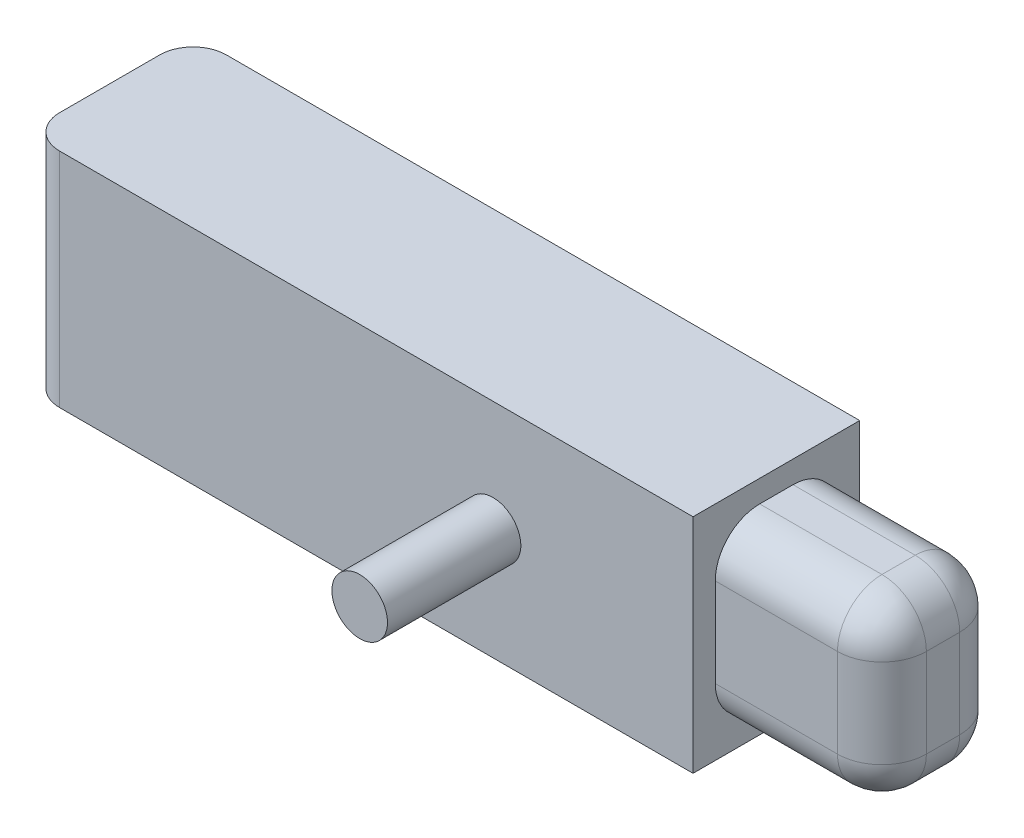
ISO-10303-21;
HEADER;
FILE_DESCRIPTION(('STEP AP214'),'2;1');
FILE_NAME('part.step','',(''),(''),'','','');
FILE_SCHEMA(('AUTOMOTIVE_DESIGN { 1 0 10303 214 1 1 1 1 }'));
ENDSEC;
DATA;
#1=APPLICATION_CONTEXT('core data for automotive mechanical design processes');
#2=APPLICATION_PROTOCOL_DEFINITION('international standard','automotive_design',2000,#1);
#3=PRODUCT_CONTEXT('',#1,'mechanical');
#4=PRODUCT('Part','Part','',(#3));
#5=PRODUCT_RELATED_PRODUCT_CATEGORY('part','',(#4));
#6=PRODUCT_DEFINITION_FORMATION('','',#4);
#7=PRODUCT_DEFINITION_CONTEXT('part definition',#1,'design');
#8=PRODUCT_DEFINITION('design','',#6,#7);
#9=PRODUCT_DEFINITION_SHAPE('','',#8);
#10=(LENGTH_UNIT() NAMED_UNIT(*) SI_UNIT(.MILLI.,.METRE.));
#11=(NAMED_UNIT(*) PLANE_ANGLE_UNIT() SI_UNIT($,.RADIAN.));
#12=(NAMED_UNIT(*) SI_UNIT($,.STERADIAN.) SOLID_ANGLE_UNIT());
#13=UNCERTAINTY_MEASURE_WITH_UNIT(LENGTH_MEASURE(1.E-05),#10,'distance_accuracy_value','');
#14=(GEOMETRIC_REPRESENTATION_CONTEXT(3) GLOBAL_UNCERTAINTY_ASSIGNED_CONTEXT((#13)) GLOBAL_UNIT_ASSIGNED_CONTEXT((#10,
#11,#12)) REPRESENTATION_CONTEXT('',''));
#15=CARTESIAN_POINT('',(0.,0.,0.));
#16=DIRECTION('',(0.,0.,1.));
#17=DIRECTION('',(1.,0.,0.));
#18=AXIS2_PLACEMENT_3D('',#15,#16,#17);
#19=CARTESIAN_POINT('',(55.594721876326,30.,14.8444549595951));
#20=DIRECTION('',(-1.,0.,0.));
#21=DIRECTION('',(0.,0.,1.));
#22=AXIS2_PLACEMENT_3D('',#19,#20,#21);
#23=PLANE('',#22);
#24=DIRECTION('',(0.,0.,-1.));
#25=VECTOR('',#24,1.);
#26=CARTESIAN_POINT('',(55.594721876326,-10.,14.8444549595951));
#27=LINE('',#26,#25);
#28=CARTESIAN_POINT('',(55.594721876326,-10.,14.8444549595951));
#29=VERTEX_POINT('',#28);
#30=CARTESIAN_POINT('',(55.594721876326,-10.,-15.1555450404049));
#31=VERTEX_POINT('',#30);
#32=EDGE_CURVE('E187',#29,#31,#27,.T.);
#33=ORIENTED_EDGE('',*,*,#32,.T.);
#34=DIRECTION('',(0.,-1.,0.));
#35=VECTOR('',#34,1.);
#36=CARTESIAN_POINT('',(55.594721876326,30.,-15.1555450404049));
#37=LINE('',#36,#35);
#38=CARTESIAN_POINT('',(55.594721876326,30.,-15.1555450404049));
#39=VERTEX_POINT('',#38);
#40=EDGE_CURVE('E173',#39,#31,#37,.T.);
#41=ORIENTED_EDGE('',*,*,#40,.F.);
#42=DIRECTION('',(0.,0.,-1.));
#43=VECTOR('',#42,1.);
#44=CARTESIAN_POINT('',(55.594721876326,30.,14.8444549595951));
#45=LINE('',#44,#43);
#46=CARTESIAN_POINT('',(55.594721876326,30.,14.8444549595951));
#47=VERTEX_POINT('',#46);
#48=EDGE_CURVE('E159',#47,#39,#45,.T.);
#49=ORIENTED_EDGE('',*,*,#48,.F.);
#50=DIRECTION('',(0.,-1.,0.));
#51=VECTOR('',#50,1.);
#52=CARTESIAN_POINT('',(55.594721876326,30.,14.8444549595951));
#53=LINE('',#52,#51);
#54=EDGE_CURVE('E166',#47,#29,#53,.T.);
#55=ORIENTED_EDGE('',*,*,#54,.T.);
#56=EDGE_LOOP('',(#33,#41,#49,#55));
#57=FACE_BOUND('',#56,.T.);
#58=DIRECTION('',(0.,-1.,0.));
#59=VECTOR('',#58,1.);
#60=CARTESIAN_POINT('',(55.594721876326,-6.,10.8444549595951));
#61=LINE('',#60,#59);
#62=CARTESIAN_POINT('',(55.594721876326,18.,10.8444549595951));
#63=VERTEX_POINT('',#62);
#64=CARTESIAN_POINT('',(55.594721876326,2.,10.8444549595951));
#65=VERTEX_POINT('',#64);
#66=EDGE_CURVE('E271',#63,#65,#61,.T.);
#67=ORIENTED_EDGE('',*,*,#66,.F.);
#68=CARTESIAN_POINT('',(55.594721876326,18.,2.84445495959507));
#69=DIRECTION('',(-1.,0.,0.));
#70=DIRECTION('',(0.,0.,1.));
#71=AXIS2_PLACEMENT_3D('',#68,#69,#70);
#72=CIRCLE('',#71,8.);
#73=CARTESIAN_POINT('',(55.594721876326,26.,2.84445495959507));
#74=VERTEX_POINT('',#73);
#75=EDGE_CURVE('E220',#63,#74,#72,.T.);
#76=ORIENTED_EDGE('',*,*,#75,.T.);
#77=DIRECTION('',(0.,0.,1.));
#78=VECTOR('',#77,1.);
#79=CARTESIAN_POINT('',(55.594721876326,26.,-11.1555450404049));
#80=LINE('',#79,#78);
#81=CARTESIAN_POINT('',(55.594721876326,26.,-3.15554504040493));
#82=VERTEX_POINT('',#81);
#83=EDGE_CURVE('E556',#82,#74,#80,.T.);
#84=ORIENTED_EDGE('',*,*,#83,.F.);
#85=CARTESIAN_POINT('',(55.594721876326,18.,-3.15554504040493));
#86=DIRECTION('',(-1.,0.,0.));
#87=DIRECTION('',(0.,0.,1.));
#88=AXIS2_PLACEMENT_3D('',#85,#86,#87);
#89=CIRCLE('',#88,8.);
#90=CARTESIAN_POINT('',(55.594721876326,18.,-11.1555450404049));
#91=VERTEX_POINT('',#90);
#92=EDGE_CURVE('E214',#82,#91,#89,.T.);
#93=ORIENTED_EDGE('',*,*,#92,.T.);
#94=DIRECTION('',(0.,1.,0.));
#95=VECTOR('',#94,1.);
#96=CARTESIAN_POINT('',(55.594721876326,-6.,-11.1555450404049));
#97=LINE('',#96,#95);
#98=CARTESIAN_POINT('',(55.594721876326,2.,-11.1555450404049));
#99=VERTEX_POINT('',#98);
#100=EDGE_CURVE('E559',#99,#91,#97,.T.);
#101=ORIENTED_EDGE('',*,*,#100,.F.);
#102=CARTESIAN_POINT('',(55.594721876326,2.,-3.15554504040493));
#103=DIRECTION('',(-1.,0.,0.));
#104=DIRECTION('',(0.,0.,1.));
#105=AXIS2_PLACEMENT_3D('',#102,#103,#104);
#106=CIRCLE('',#105,8.);
#107=CARTESIAN_POINT('',(55.594721876326,-6.,-3.15554504040493));
#108=VERTEX_POINT('',#107);
#109=EDGE_CURVE('E216',#99,#108,#106,.T.);
#110=ORIENTED_EDGE('',*,*,#109,.T.);
#111=DIRECTION('',(0.,0.,-1.));
#112=VECTOR('',#111,1.);
#113=CARTESIAN_POINT('',(55.594721876326,-6.,-11.1555450404049));
#114=LINE('',#113,#112);
#115=CARTESIAN_POINT('',(55.594721876326,-6.,2.84445495959507));
#116=VERTEX_POINT('',#115);
#117=EDGE_CURVE('E564',#116,#108,#114,.T.);
#118=ORIENTED_EDGE('',*,*,#117,.F.);
#119=CARTESIAN_POINT('',(55.594721876326,2.,2.84445495959507));
#120=DIRECTION('',(-1.,0.,0.));
#121=DIRECTION('',(0.,0.,1.));
#122=AXIS2_PLACEMENT_3D('',#119,#120,#121);
#123=CIRCLE('',#122,8.);
#124=EDGE_CURVE('E218',#116,#65,#123,.T.);
#125=ORIENTED_EDGE('',*,*,#124,.T.);
#126=EDGE_LOOP('',(#67,#76,#84,#93,#101,#110,#118,#125));
#127=FACE_BOUND('',#126,.T.);
#128=ADVANCED_FACE('F42',(#57,#127),#23,.F.);
#129=CARTESIAN_POINT('',(-64.405278123674,30.,14.8444549595951));
#130=DIRECTION('',(1.,0.,0.));
#131=DIRECTION('',(0.,0.,-1.));
#132=AXIS2_PLACEMENT_3D('',#129,#130,#131);
#133=PLANE('',#132);
#134=DIRECTION('',(0.,0.,1.));
#135=VECTOR('',#134,1.);
#136=CARTESIAN_POINT('',(-64.405278123674,30.,14.8444549595951));
#137=LINE('',#136,#135);
#138=CARTESIAN_POINT('',(-64.405278123674,30.,-9.15554504040492));
#139=VERTEX_POINT('',#138);
#140=CARTESIAN_POINT('',(-64.405278123674,30.,8.84445495959508));
#141=VERTEX_POINT('',#140);
#142=EDGE_CURVE('E163',#139,#141,#137,.T.);
#143=ORIENTED_EDGE('',*,*,#142,.F.);
#144=DIRECTION('',(0.,-1.,0.));
#145=VECTOR('',#144,1.);
#146=CARTESIAN_POINT('',(-64.405278123674,30.,-9.15554504040492));
#147=LINE('',#146,#145);
#148=CARTESIAN_POINT('',(-64.405278123674,-10.,-9.15554504040492));
#149=VERTEX_POINT('',#148);
#150=EDGE_CURVE('E273',#139,#149,#147,.T.);
#151=ORIENTED_EDGE('',*,*,#150,.T.);
#152=DIRECTION('',(0.,0.,1.));
#153=VECTOR('',#152,1.);
#154=CARTESIAN_POINT('',(-64.405278123674,-10.,14.8444549595951));
#155=LINE('',#154,#153);
#156=CARTESIAN_POINT('',(-64.405278123674,-10.,8.84445495959508));
#157=VERTEX_POINT('',#156);
#158=EDGE_CURVE('E182',#149,#157,#155,.T.);
#159=ORIENTED_EDGE('',*,*,#158,.T.);
#160=DIRECTION('',(0.,-1.,0.));
#161=VECTOR('',#160,1.);
#162=CARTESIAN_POINT('',(-64.405278123674,30.,8.84445495959508));
#163=LINE('',#162,#161);
#164=EDGE_CURVE('E248',#157,#141,#163,.F.);
#165=ORIENTED_EDGE('',*,*,#164,.T.);
#166=EDGE_LOOP('',(#143,#151,#159,#165));
#167=FACE_BOUND('',#166,.T.);
#168=ADVANCED_FACE('F286',(#167),#133,.F.);
#169=CARTESIAN_POINT('',(55.594721876326,30.,14.8444549595951));
#170=DIRECTION('',(0.,0.,-1.));
#171=DIRECTION('',(-1.,0.,0.));
#172=AXIS2_PLACEMENT_3D('',#169,#170,#171);
#173=PLANE('',#172);
#174=CARTESIAN_POINT('',(19.594721876326,10.,14.8444549595951));
#175=DIRECTION('',(0.,0.,-1.));
#176=DIRECTION('',(-1.,0.,0.));
#177=AXIS2_PLACEMENT_3D('',#174,#175,#176);
#178=CIRCLE('',#177,5.);
#179=CARTESIAN_POINT('',(14.594721876326,10.,14.8444549595951));
#180=VERTEX_POINT('',#179);
#181=EDGE_CURVE('E172',#180,#180,#178,.F.);
#182=ORIENTED_EDGE('',*,*,#181,.F.);
#183=EDGE_LOOP('',(#182));
#184=FACE_BOUND('',#183,.T.);
#185=DIRECTION('',(1.,0.,0.));
#186=VECTOR('',#185,1.);
#187=CARTESIAN_POINT('',(55.594721876326,30.,14.8444549595951));
#188=LINE('',#187,#186);
#189=CARTESIAN_POINT('',(-58.405278123674,30.,14.8444549595951));
#190=VERTEX_POINT('',#189);
#191=EDGE_CURVE('E155',#190,#47,#188,.T.);
#192=ORIENTED_EDGE('',*,*,#191,.F.);
#193=DIRECTION('',(0.,-1.,0.));
#194=VECTOR('',#193,1.);
#195=CARTESIAN_POINT('',(-58.405278123674,30.,14.8444549595951));
#196=LINE('',#195,#194);
#197=CARTESIAN_POINT('',(-58.405278123674,-10.,14.8444549595951));
#198=VERTEX_POINT('',#197);
#199=EDGE_CURVE('E11',#190,#198,#196,.T.);
#200=ORIENTED_EDGE('',*,*,#199,.T.);
#201=DIRECTION('',(1.,0.,0.));
#202=VECTOR('',#201,1.);
#203=CARTESIAN_POINT('',(55.594721876326,-10.,14.8444549595951));
#204=LINE('',#203,#202);
#205=EDGE_CURVE('E169',#198,#29,#204,.T.);
#206=ORIENTED_EDGE('',*,*,#205,.T.);
#207=ORIENTED_EDGE('',*,*,#54,.F.);
#208=EDGE_LOOP('',(#192,#200,#206,#207));
#209=FACE_BOUND('',#208,.T.);
#210=ADVANCED_FACE('F167',(#184,#209),#173,.F.);
#211=CARTESIAN_POINT('',(55.594721876326,30.,-15.1555450404049));
#212=DIRECTION('',(0.,0.,1.));
#213=DIRECTION('',(1.,0.,0.));
#214=AXIS2_PLACEMENT_3D('',#211,#212,#213);
#215=PLANE('',#214);
#216=DIRECTION('',(-1.,0.,0.));
#217=VECTOR('',#216,1.);
#218=CARTESIAN_POINT('',(55.594721876326,-10.,-15.1555450404049));
#219=LINE('',#218,#217);
#220=CARTESIAN_POINT('',(-58.405278123674,-10.,-15.1555450404049));
#221=VERTEX_POINT('',#220);
#222=EDGE_CURVE('E189',#31,#221,#219,.T.);
#223=ORIENTED_EDGE('',*,*,#222,.T.);
#224=DIRECTION('',(0.,-1.,0.));
#225=VECTOR('',#224,1.);
#226=CARTESIAN_POINT('',(-58.405278123674,30.,-15.1555450404049));
#227=LINE('',#226,#225);
#228=CARTESIAN_POINT('',(-58.405278123674,30.,-15.1555450404049));
#229=VERTEX_POINT('',#228);
#230=EDGE_CURVE('E65',#221,#229,#227,.F.);
#231=ORIENTED_EDGE('',*,*,#230,.T.);
#232=DIRECTION('',(-1.,0.,0.));
#233=VECTOR('',#232,1.);
#234=CARTESIAN_POINT('',(55.594721876326,30.,-15.1555450404049));
#235=LINE('',#234,#233);
#236=EDGE_CURVE('E177',#39,#229,#235,.T.);
#237=ORIENTED_EDGE('',*,*,#236,.F.);
#238=ORIENTED_EDGE('',*,*,#40,.T.);
#239=EDGE_LOOP('',(#223,#231,#237,#238));
#240=FACE_BOUND('',#239,.T.);
#241=ADVANCED_FACE('F293',(#240),#215,.F.);
#242=CARTESIAN_POINT('',(-4.40527812367396,30.,-0.155545040404923));
#243=DIRECTION('',(0.,1.,0.));
#244=DIRECTION('',(0.,0.,1.));
#245=AXIS2_PLACEMENT_3D('',#242,#243,#244);
#246=PLANE('',#245);
#247=ORIENTED_EDGE('',*,*,#236,.T.);
#248=CARTESIAN_POINT('',(-58.405278123674,30.,-9.15554504040492));
#249=DIRECTION('',(0.,1.,0.));
#250=DIRECTION('',(0.,0.,1.));
#251=AXIS2_PLACEMENT_3D('',#248,#249,#250);
#252=CIRCLE('',#251,6.);
#253=EDGE_CURVE('E50',#229,#139,#252,.T.);
#254=ORIENTED_EDGE('',*,*,#253,.T.);
#255=ORIENTED_EDGE('',*,*,#142,.T.);
#256=CARTESIAN_POINT('',(-58.405278123674,30.,8.84445495959508));
#257=DIRECTION('',(0.,1.,0.));
#258=DIRECTION('',(0.,0.,1.));
#259=AXIS2_PLACEMENT_3D('',#256,#257,#258);
#260=CIRCLE('',#259,6.);
#261=EDGE_CURVE('E57',#141,#190,#260,.T.);
#262=ORIENTED_EDGE('',*,*,#261,.T.);
#263=ORIENTED_EDGE('',*,*,#191,.T.);
#264=ORIENTED_EDGE('',*,*,#48,.T.);
#265=EDGE_LOOP('',(#247,#254,#255,#262,#263,#264));
#266=FACE_BOUND('',#265,.T.);
#267=ADVANCED_FACE('F157',(#266),#246,.T.);
#268=CARTESIAN_POINT('',(-4.40527812367396,-10.,-0.155545040404923));
#269=DIRECTION('',(0.,1.,0.));
#270=DIRECTION('',(0.,0.,1.));
#271=AXIS2_PLACEMENT_3D('',#268,#269,#270);
#272=PLANE('',#271);
#273=ORIENTED_EDGE('',*,*,#158,.F.);
#274=CARTESIAN_POINT('',(-58.405278123674,-10.,-9.15554504040492));
#275=DIRECTION('',(0.,1.,0.));
#276=DIRECTION('',(0.,0.,1.));
#277=AXIS2_PLACEMENT_3D('',#274,#275,#276);
#278=CIRCLE('',#277,6.);
#279=EDGE_CURVE('E278',#149,#221,#278,.F.);
#280=ORIENTED_EDGE('',*,*,#279,.T.);
#281=ORIENTED_EDGE('',*,*,#222,.F.);
#282=ORIENTED_EDGE('',*,*,#32,.F.);
#283=ORIENTED_EDGE('',*,*,#205,.F.);
#284=CARTESIAN_POINT('',(-58.405278123674,-10.,8.84445495959508));
#285=DIRECTION('',(0.,1.,0.));
#286=DIRECTION('',(0.,0.,1.));
#287=AXIS2_PLACEMENT_3D('',#284,#285,#286);
#288=CIRCLE('',#287,6.);
#289=EDGE_CURVE('E276',#198,#157,#288,.F.);
#290=ORIENTED_EDGE('',*,*,#289,.T.);
#291=EDGE_LOOP('',(#273,#280,#281,#282,#283,#290));
#292=FACE_BOUND('',#291,.T.);
#293=ADVANCED_FACE('F292',(#292),#272,.F.);
#294=CARTESIAN_POINT('',(19.594721876326,10.,38.8444549595951));
#295=DIRECTION('',(0.,0.,-1.));
#296=DIRECTION('',(-1.,0.,0.));
#297=AXIS2_PLACEMENT_3D('',#294,#295,#296);
#298=CYLINDRICAL_SURFACE('',#297,5.);
#299=CARTESIAN_POINT('',(19.594721876326,10.,38.8444549595951));
#300=DIRECTION('',(0.,0.,1.));
#301=DIRECTION('',(1.,0.,0.));
#302=AXIS2_PLACEMENT_3D('',#299,#300,#301);
#303=CIRCLE('',#302,5.);
#304=CARTESIAN_POINT('',(24.594721876326,10.,38.8444549595951));
#305=VERTEX_POINT('',#304);
#306=EDGE_CURVE('E185',#305,#305,#303,.T.);
#307=ORIENTED_EDGE('',*,*,#306,.F.);
#308=EDGE_LOOP('',(#307));
#309=FACE_BOUND('',#308,.T.);
#310=ORIENTED_EDGE('',*,*,#181,.T.);
#311=EDGE_LOOP('',(#310));
#312=FACE_BOUND('',#311,.T.);
#313=ADVANCED_FACE('F506',(#309,#312),#298,.T.);
#314=CARTESIAN_POINT('',(19.594721876326,10.,38.8444549595951));
#315=DIRECTION('',(0.,0.,1.));
#316=DIRECTION('',(1.,0.,0.));
#317=AXIS2_PLACEMENT_3D('',#314,#315,#316);
#318=PLANE('',#317);
#319=ORIENTED_EDGE('',*,*,#306,.T.);
#320=EDGE_LOOP('',(#319));
#321=FACE_BOUND('',#320,.T.);
#322=ADVANCED_FACE('F495',(#321),#318,.T.);
#323=CARTESIAN_POINT('',(85.594721876326,-6.,10.8444549595951));
#324=DIRECTION('',(0.,0.,-1.));
#325=DIRECTION('',(-1.,0.,0.));
#326=AXIS2_PLACEMENT_3D('',#323,#324,#325);
#327=PLANE('',#326);
#328=DIRECTION('',(-1.,0.,0.));
#329=VECTOR('',#328,1.);
#330=CARTESIAN_POINT('',(85.594721876326,2.,10.8444549595951));
#331=LINE('',#330,#329);
#332=CARTESIAN_POINT('',(77.594721876326,2.,10.8444549595951));
#333=VERTEX_POINT('',#332);
#334=EDGE_CURVE('E211',#65,#333,#331,.F.);
#335=ORIENTED_EDGE('',*,*,#334,.T.);
#336=DIRECTION('',(0.,-1.,0.));
#337=VECTOR('',#336,1.);
#338=CARTESIAN_POINT('',(77.594721876326,18.,10.8444549595951));
#339=LINE('',#338,#337);
#340=CARTESIAN_POINT('',(77.594721876326,18.,10.8444549595951));
#341=VERTEX_POINT('',#340);
#342=EDGE_CURVE('E238',#333,#341,#339,.F.);
#343=ORIENTED_EDGE('',*,*,#342,.T.);
#344=DIRECTION('',(-1.,0.,0.));
#345=VECTOR('',#344,1.);
#346=CARTESIAN_POINT('',(85.594721876326,18.,10.8444549595951));
#347=LINE('',#346,#345);
#348=EDGE_CURVE('E209',#341,#63,#347,.T.);
#349=ORIENTED_EDGE('',*,*,#348,.T.);
#350=ORIENTED_EDGE('',*,*,#66,.T.);
#351=EDGE_LOOP('',(#335,#343,#349,#350));
#352=FACE_BOUND('',#351,.T.);
#353=ADVANCED_FACE('F485',(#352),#327,.F.);
#354=CARTESIAN_POINT('',(85.594721876326,-6.,-11.1555450404049));
#355=DIRECTION('',(0.,1.,0.));
#356=DIRECTION('',(0.,0.,1.));
#357=AXIS2_PLACEMENT_3D('',#354,#355,#356);
#358=PLANE('',#357);
#359=DIRECTION('',(-1.,0.,0.));
#360=VECTOR('',#359,1.);
#361=CARTESIAN_POINT('',(85.594721876326,-6.,-3.15554504040493));
#362=LINE('',#361,#360);
#363=CARTESIAN_POINT('',(77.594721876326,-6.,-3.15554504040493));
#364=VERTEX_POINT('',#363);
#365=EDGE_CURVE('E206',#108,#364,#362,.F.);
#366=ORIENTED_EDGE('',*,*,#365,.T.);
#367=DIRECTION('',(0.,0.,-1.));
#368=VECTOR('',#367,1.);
#369=CARTESIAN_POINT('',(77.594721876326,-6.,2.84445495959507));
#370=LINE('',#369,#368);
#371=CARTESIAN_POINT('',(77.594721876326,-6.,2.84445495959507));
#372=VERTEX_POINT('',#371);
#373=EDGE_CURVE('E234',#364,#372,#370,.F.);
#374=ORIENTED_EDGE('',*,*,#373,.T.);
#375=DIRECTION('',(-1.,0.,0.));
#376=VECTOR('',#375,1.);
#377=CARTESIAN_POINT('',(85.594721876326,-6.,2.84445495959507));
#378=LINE('',#377,#376);
#379=EDGE_CURVE('E204',#372,#116,#378,.T.);
#380=ORIENTED_EDGE('',*,*,#379,.T.);
#381=ORIENTED_EDGE('',*,*,#117,.T.);
#382=EDGE_LOOP('',(#366,#374,#380,#381));
#383=FACE_BOUND('',#382,.T.);
#384=ADVANCED_FACE('F475',(#383),#358,.F.);
#385=CARTESIAN_POINT('',(85.594721876326,-6.,-11.1555450404049));
#386=DIRECTION('',(0.,0.,1.));
#387=DIRECTION('',(1.,0.,0.));
#388=AXIS2_PLACEMENT_3D('',#385,#386,#387);
#389=PLANE('',#388);
#390=DIRECTION('',(-1.,0.,0.));
#391=VECTOR('',#390,1.);
#392=CARTESIAN_POINT('',(85.594721876326,18.,-11.1555450404049));
#393=LINE('',#392,#391);
#394=CARTESIAN_POINT('',(77.594721876326,18.,-11.1555450404049));
#395=VERTEX_POINT('',#394);
#396=EDGE_CURVE('E201',#91,#395,#393,.F.);
#397=ORIENTED_EDGE('',*,*,#396,.T.);
#398=DIRECTION('',(0.,1.,0.));
#399=VECTOR('',#398,1.);
#400=CARTESIAN_POINT('',(77.594721876326,2.,-11.1555450404049));
#401=LINE('',#400,#399);
#402=CARTESIAN_POINT('',(77.594721876326,2.,-11.1555450404049));
#403=VERTEX_POINT('',#402);
#404=EDGE_CURVE('E246',#395,#403,#401,.F.);
#405=ORIENTED_EDGE('',*,*,#404,.T.);
#406=DIRECTION('',(-1.,0.,0.));
#407=VECTOR('',#406,1.);
#408=CARTESIAN_POINT('',(85.594721876326,2.,-11.1555450404049));
#409=LINE('',#408,#407);
#410=EDGE_CURVE('E199',#403,#99,#409,.T.);
#411=ORIENTED_EDGE('',*,*,#410,.T.);
#412=ORIENTED_EDGE('',*,*,#100,.T.);
#413=EDGE_LOOP('',(#397,#405,#411,#412));
#414=FACE_BOUND('',#413,.T.);
#415=ADVANCED_FACE('F465',(#414),#389,.F.);
#416=CARTESIAN_POINT('',(85.594721876326,26.,-11.1555450404049));
#417=DIRECTION('',(0.,-1.,0.));
#418=DIRECTION('',(0.,0.,-1.));
#419=AXIS2_PLACEMENT_3D('',#416,#417,#418);
#420=PLANE('',#419);
#421=DIRECTION('',(-1.,0.,0.));
#422=VECTOR('',#421,1.);
#423=CARTESIAN_POINT('',(85.594721876326,26.,2.84445495959507));
#424=LINE('',#423,#422);
#425=CARTESIAN_POINT('',(77.594721876326,26.,2.84445495959507));
#426=VERTEX_POINT('',#425);
#427=EDGE_CURVE('E194',#74,#426,#424,.F.);
#428=ORIENTED_EDGE('',*,*,#427,.T.);
#429=DIRECTION('',(0.,0.,1.));
#430=VECTOR('',#429,1.);
#431=CARTESIAN_POINT('',(77.594721876326,26.,-3.15554504040493));
#432=LINE('',#431,#430);
#433=CARTESIAN_POINT('',(77.594721876326,26.,-3.15554504040493));
#434=VERTEX_POINT('',#433);
#435=EDGE_CURVE('E242',#426,#434,#432,.F.);
#436=ORIENTED_EDGE('',*,*,#435,.T.);
#437=DIRECTION('',(-1.,0.,0.));
#438=VECTOR('',#437,1.);
#439=CARTESIAN_POINT('',(85.594721876326,26.,-3.15554504040493));
#440=LINE('',#439,#438);
#441=EDGE_CURVE('E197',#434,#82,#440,.T.);
#442=ORIENTED_EDGE('',*,*,#441,.T.);
#443=ORIENTED_EDGE('',*,*,#83,.T.);
#444=EDGE_LOOP('',(#428,#436,#442,#443));
#445=FACE_BOUND('',#444,.T.);
#446=ADVANCED_FACE('F455',(#445),#420,.F.);
#447=CARTESIAN_POINT('',(85.594721876326,-10.,-0.155545040404923));
#448=DIRECTION('',(1.,0.,0.));
#449=DIRECTION('',(0.,0.,-1.));
#450=AXIS2_PLACEMENT_3D('',#447,#448,#449);
#451=PLANE('',#450);
#452=DIRECTION('',(0.,-1.,0.));
#453=VECTOR('',#452,1.);
#454=CARTESIAN_POINT('',(85.594721876326,2.,2.84445495959507));
#455=LINE('',#454,#453);
#456=CARTESIAN_POINT('',(85.594721876326,18.,2.84445495959507));
#457=VERTEX_POINT('',#456);
#458=CARTESIAN_POINT('',(85.594721876326,2.,2.84445495959507));
#459=VERTEX_POINT('',#458);
#460=EDGE_CURVE('E229',#457,#459,#455,.T.);
#461=ORIENTED_EDGE('',*,*,#460,.T.);
#462=DIRECTION('',(0.,0.,-1.));
#463=VECTOR('',#462,1.);
#464=CARTESIAN_POINT('',(85.594721876326,2.,-3.15554504040493));
#465=LINE('',#464,#463);
#466=CARTESIAN_POINT('',(85.594721876326,2.,-3.15554504040493));
#467=VERTEX_POINT('',#466);
#468=EDGE_CURVE('E231',#459,#467,#465,.T.);
#469=ORIENTED_EDGE('',*,*,#468,.T.);
#470=DIRECTION('',(0.,1.,0.));
#471=VECTOR('',#470,1.);
#472=CARTESIAN_POINT('',(85.594721876326,18.,-3.15554504040493));
#473=LINE('',#472,#471);
#474=CARTESIAN_POINT('',(85.594721876326,18.,-3.15554504040493));
#475=VERTEX_POINT('',#474);
#476=EDGE_CURVE('E225',#467,#475,#473,.T.);
#477=ORIENTED_EDGE('',*,*,#476,.T.);
#478=DIRECTION('',(0.,0.,1.));
#479=VECTOR('',#478,1.);
#480=CARTESIAN_POINT('',(85.594721876326,18.,2.84445495959507));
#481=LINE('',#480,#479);
#482=EDGE_CURVE('E227',#475,#457,#481,.T.);
#483=ORIENTED_EDGE('',*,*,#482,.T.);
#484=EDGE_LOOP('',(#461,#469,#477,#483));
#485=FACE_BOUND('',#484,.T.);
#486=ADVANCED_FACE('F315',(#485),#451,.T.);
#487=CARTESIAN_POINT('',(85.594721876326,18.,-3.15554504040493));
#488=DIRECTION('',(-1.,0.,0.));
#489=DIRECTION('',(0.,0.,1.));
#490=AXIS2_PLACEMENT_3D('',#487,#488,#489);
#491=CYLINDRICAL_SURFACE('',#490,8.);
#492=ORIENTED_EDGE('',*,*,#441,.F.);
#493=CARTESIAN_POINT('',(77.594721876326,18.,-3.15554504040493));
#494=DIRECTION('',(-1.,0.,0.));
#495=DIRECTION('',(0.,0.,1.));
#496=AXIS2_PLACEMENT_3D('',#493,#494,#495);
#497=CIRCLE('',#496,8.);
#498=EDGE_CURVE('E244',#434,#395,#497,.T.);
#499=ORIENTED_EDGE('',*,*,#498,.T.);
#500=ORIENTED_EDGE('',*,*,#396,.F.);
#501=ORIENTED_EDGE('',*,*,#92,.F.);
#502=EDGE_LOOP('',(#492,#499,#500,#501));
#503=FACE_BOUND('',#502,.T.);
#504=ADVANCED_FACE('F311',(#503),#491,.T.);
#505=CARTESIAN_POINT('',(85.594721876326,2.,-3.15554504040493));
#506=DIRECTION('',(-1.,0.,0.));
#507=DIRECTION('',(0.,0.,1.));
#508=AXIS2_PLACEMENT_3D('',#505,#506,#507);
#509=CYLINDRICAL_SURFACE('',#508,8.);
#510=ORIENTED_EDGE('',*,*,#410,.F.);
#511=CARTESIAN_POINT('',(77.594721876326,2.,-3.15554504040493));
#512=DIRECTION('',(-1.,0.,0.));
#513=DIRECTION('',(0.,0.,1.));
#514=AXIS2_PLACEMENT_3D('',#511,#512,#513);
#515=CIRCLE('',#514,8.);
#516=EDGE_CURVE('E222',#403,#364,#515,.T.);
#517=ORIENTED_EDGE('',*,*,#516,.T.);
#518=ORIENTED_EDGE('',*,*,#365,.F.);
#519=ORIENTED_EDGE('',*,*,#109,.F.);
#520=EDGE_LOOP('',(#510,#517,#518,#519));
#521=FACE_BOUND('',#520,.T.);
#522=ADVANCED_FACE('F314',(#521),#509,.T.);
#523=CARTESIAN_POINT('',(85.594721876326,2.,2.84445495959507));
#524=DIRECTION('',(-1.,0.,0.));
#525=DIRECTION('',(0.,0.,1.));
#526=AXIS2_PLACEMENT_3D('',#523,#524,#525);
#527=CYLINDRICAL_SURFACE('',#526,8.);
#528=ORIENTED_EDGE('',*,*,#379,.F.);
#529=CARTESIAN_POINT('',(77.594721876326,2.,2.84445495959507));
#530=DIRECTION('',(-1.,0.,0.));
#531=DIRECTION('',(0.,0.,1.));
#532=AXIS2_PLACEMENT_3D('',#529,#530,#531);
#533=CIRCLE('',#532,8.);
#534=EDGE_CURVE('E236',#372,#333,#533,.T.);
#535=ORIENTED_EDGE('',*,*,#534,.T.);
#536=ORIENTED_EDGE('',*,*,#334,.F.);
#537=ORIENTED_EDGE('',*,*,#124,.F.);
#538=EDGE_LOOP('',(#528,#535,#536,#537));
#539=FACE_BOUND('',#538,.T.);
#540=ADVANCED_FACE('F319',(#539),#527,.T.);
#541=CARTESIAN_POINT('',(85.594721876326,18.,2.84445495959507));
#542=DIRECTION('',(-1.,0.,0.));
#543=DIRECTION('',(0.,0.,1.));
#544=AXIS2_PLACEMENT_3D('',#541,#542,#543);
#545=CYLINDRICAL_SURFACE('',#544,8.);
#546=ORIENTED_EDGE('',*,*,#348,.F.);
#547=CARTESIAN_POINT('',(77.594721876326,18.,2.84445495959507));
#548=DIRECTION('',(-1.,0.,0.));
#549=DIRECTION('',(0.,0.,1.));
#550=AXIS2_PLACEMENT_3D('',#547,#548,#549);
#551=CIRCLE('',#550,8.);
#552=EDGE_CURVE('E240',#341,#426,#551,.T.);
#553=ORIENTED_EDGE('',*,*,#552,.T.);
#554=ORIENTED_EDGE('',*,*,#427,.F.);
#555=ORIENTED_EDGE('',*,*,#75,.F.);
#556=EDGE_LOOP('',(#546,#553,#554,#555));
#557=FACE_BOUND('',#556,.T.);
#558=ADVANCED_FACE('F323',(#557),#545,.T.);
#559=CARTESIAN_POINT('',(77.594721876326,18.,2.84445495959507));
#560=DIRECTION('',(1.,0.,0.));
#561=DIRECTION('',(0.,0.,-1.));
#562=AXIS2_PLACEMENT_3D('',#559,#560,#561);
#563=SPHERICAL_SURFACE('',#562,8.);
#564=CARTESIAN_POINT('',(77.594721876326,18.,2.84445495959507));
#565=DIRECTION('',(0.,0.,-1.));
#566=DIRECTION('',(-1.,0.,0.));
#567=AXIS2_PLACEMENT_3D('',#564,#565,#566);
#568=CIRCLE('',#567,8.);
#569=EDGE_CURVE('E265',#426,#457,#568,.T.);
#570=ORIENTED_EDGE('',*,*,#569,.F.);
#571=ORIENTED_EDGE('',*,*,#552,.F.);
#572=CARTESIAN_POINT('',(77.594721876326,18.,2.84445495959507));
#573=DIRECTION('',(0.,-1.,0.));
#574=DIRECTION('',(0.,0.,-1.));
#575=AXIS2_PLACEMENT_3D('',#572,#573,#574);
#576=CIRCLE('',#575,8.);
#577=EDGE_CURVE('E268',#457,#341,#576,.T.);
#578=ORIENTED_EDGE('',*,*,#577,.F.);
#579=EDGE_LOOP('',(#570,#571,#578));
#580=FACE_BOUND('',#579,.T.);
#581=ADVANCED_FACE('F327',(#580),#563,.T.);
#582=CARTESIAN_POINT('',(77.594721876326,-10.,2.84445495959507));
#583=DIRECTION('',(0.,1.,0.));
#584=DIRECTION('',(0.,0.,1.));
#585=AXIS2_PLACEMENT_3D('',#582,#583,#584);
#586=CYLINDRICAL_SURFACE('',#585,8.);
#587=ORIENTED_EDGE('',*,*,#577,.T.);
#588=ORIENTED_EDGE('',*,*,#342,.F.);
#589=CARTESIAN_POINT('',(77.594721876326,2.,2.84445495959507));
#590=DIRECTION('',(0.,-1.,0.));
#591=DIRECTION('',(0.,0.,-1.));
#592=AXIS2_PLACEMENT_3D('',#589,#590,#591);
#593=CIRCLE('',#592,8.);
#594=EDGE_CURVE('E262',#459,#333,#593,.T.);
#595=ORIENTED_EDGE('',*,*,#594,.F.);
#596=ORIENTED_EDGE('',*,*,#460,.F.);
#597=EDGE_LOOP('',(#587,#588,#595,#596));
#598=FACE_BOUND('',#597,.T.);
#599=ADVANCED_FACE('F352',(#598),#586,.T.);
#600=CARTESIAN_POINT('',(77.594721876326,18.,-0.155545040404923));
#601=DIRECTION('',(0.,0.,-1.));
#602=DIRECTION('',(-1.,0.,0.));
#603=AXIS2_PLACEMENT_3D('',#600,#601,#602);
#604=CYLINDRICAL_SURFACE('',#603,8.);
#605=ORIENTED_EDGE('',*,*,#569,.T.);
#606=ORIENTED_EDGE('',*,*,#482,.F.);
#607=CARTESIAN_POINT('',(77.594721876326,18.,-3.15554504040493));
#608=DIRECTION('',(0.,0.,-1.));
#609=DIRECTION('',(-1.,0.,0.));
#610=AXIS2_PLACEMENT_3D('',#607,#608,#609);
#611=CIRCLE('',#610,8.);
#612=EDGE_CURVE('E259',#434,#475,#611,.T.);
#613=ORIENTED_EDGE('',*,*,#612,.F.);
#614=ORIENTED_EDGE('',*,*,#435,.F.);
#615=EDGE_LOOP('',(#605,#606,#613,#614));
#616=FACE_BOUND('',#615,.T.);
#617=ADVANCED_FACE('F348',(#616),#604,.T.);
#618=CARTESIAN_POINT('',(77.594721876326,2.,2.84445495959507));
#619=DIRECTION('',(1.,0.,0.));
#620=DIRECTION('',(0.,0.,-1.));
#621=AXIS2_PLACEMENT_3D('',#618,#619,#620);
#622=SPHERICAL_SURFACE('',#621,8.);
#623=ORIENTED_EDGE('',*,*,#594,.T.);
#624=ORIENTED_EDGE('',*,*,#534,.F.);
#625=CARTESIAN_POINT('',(77.594721876326,2.,2.84445495959507));
#626=DIRECTION('',(0.,0.,-1.));
#627=DIRECTION('',(-1.,0.,0.));
#628=AXIS2_PLACEMENT_3D('',#625,#626,#627);
#629=CIRCLE('',#628,8.);
#630=EDGE_CURVE('E256',#459,#372,#629,.T.);
#631=ORIENTED_EDGE('',*,*,#630,.F.);
#632=EDGE_LOOP('',(#623,#624,#631));
#633=FACE_BOUND('',#632,.T.);
#634=ADVANCED_FACE('F344',(#633),#622,.T.);
#635=CARTESIAN_POINT('',(77.594721876326,18.,-3.15554504040493));
#636=DIRECTION('',(1.,0.,0.));
#637=DIRECTION('',(0.,0.,-1.));
#638=AXIS2_PLACEMENT_3D('',#635,#636,#637);
#639=SPHERICAL_SURFACE('',#638,8.);
#640=ORIENTED_EDGE('',*,*,#498,.F.);
#641=ORIENTED_EDGE('',*,*,#612,.T.);
#642=CARTESIAN_POINT('',(77.594721876326,18.,-3.15554504040493));
#643=DIRECTION('',(0.,-1.,0.));
#644=DIRECTION('',(0.,0.,-1.));
#645=AXIS2_PLACEMENT_3D('',#642,#643,#644);
#646=CIRCLE('',#645,8.);
#647=EDGE_CURVE('E253',#395,#475,#646,.T.);
#648=ORIENTED_EDGE('',*,*,#647,.F.);
#649=EDGE_LOOP('',(#640,#641,#648));
#650=FACE_BOUND('',#649,.T.);
#651=ADVANCED_FACE('F340',(#650),#639,.T.);
#652=CARTESIAN_POINT('',(77.594721876326,2.,-0.155545040404921));
#653=DIRECTION('',(0.,0.,1.));
#654=DIRECTION('',(0.,-1.,0.));
#655=AXIS2_PLACEMENT_3D('',#652,#653,#654);
#656=CYLINDRICAL_SURFACE('',#655,8.);
#657=ORIENTED_EDGE('',*,*,#630,.T.);
#658=ORIENTED_EDGE('',*,*,#373,.F.);
#659=CARTESIAN_POINT('',(77.594721876326,2.,-3.15554504040493));
#660=DIRECTION('',(0.,0.,-1.));
#661=DIRECTION('',(-1.,0.,0.));
#662=AXIS2_PLACEMENT_3D('',#659,#660,#661);
#663=CIRCLE('',#662,8.);
#664=EDGE_CURVE('E251',#467,#364,#663,.T.);
#665=ORIENTED_EDGE('',*,*,#664,.F.);
#666=ORIENTED_EDGE('',*,*,#468,.F.);
#667=EDGE_LOOP('',(#657,#658,#665,#666));
#668=FACE_BOUND('',#667,.T.);
#669=ADVANCED_FACE('F336',(#668),#656,.T.);
#670=CARTESIAN_POINT('',(77.594721876326,-10.,-3.15554504040493));
#671=DIRECTION('',(0.,-1.,0.));
#672=DIRECTION('',(0.,0.,-1.));
#673=AXIS2_PLACEMENT_3D('',#670,#671,#672);
#674=CYLINDRICAL_SURFACE('',#673,8.);
#675=ORIENTED_EDGE('',*,*,#647,.T.);
#676=ORIENTED_EDGE('',*,*,#476,.F.);
#677=CARTESIAN_POINT('',(77.594721876326,2.,-3.15554504040493));
#678=DIRECTION('',(0.,-1.,0.));
#679=DIRECTION('',(0.,0.,-1.));
#680=AXIS2_PLACEMENT_3D('',#677,#678,#679);
#681=CIRCLE('',#680,8.);
#682=EDGE_CURVE('E249',#403,#467,#681,.T.);
#683=ORIENTED_EDGE('',*,*,#682,.F.);
#684=ORIENTED_EDGE('',*,*,#404,.F.);
#685=EDGE_LOOP('',(#675,#676,#683,#684));
#686=FACE_BOUND('',#685,.T.);
#687=ADVANCED_FACE('F332',(#686),#674,.T.);
#688=CARTESIAN_POINT('',(77.594721876326,2.,-3.15554504040493));
#689=DIRECTION('',(1.,0.,0.));
#690=DIRECTION('',(0.,0.,-1.));
#691=AXIS2_PLACEMENT_3D('',#688,#689,#690);
#692=SPHERICAL_SURFACE('',#691,8.);
#693=ORIENTED_EDGE('',*,*,#664,.T.);
#694=ORIENTED_EDGE('',*,*,#516,.F.);
#695=ORIENTED_EDGE('',*,*,#682,.T.);
#696=EDGE_LOOP('',(#693,#694,#695));
#697=FACE_BOUND('',#696,.T.);
#698=ADVANCED_FACE('F329',(#697),#692,.T.);
#699=CARTESIAN_POINT('',(-58.405278123674,30.,-9.15554504040492));
#700=DIRECTION('',(0.,-1.,0.));
#701=DIRECTION('',(0.,0.,-1.));
#702=AXIS2_PLACEMENT_3D('',#699,#700,#701);
#703=CYLINDRICAL_SURFACE('',#702,6.);
#704=ORIENTED_EDGE('',*,*,#253,.F.);
#705=ORIENTED_EDGE('',*,*,#230,.F.);
#706=ORIENTED_EDGE('',*,*,#279,.F.);
#707=ORIENTED_EDGE('',*,*,#150,.F.);
#708=EDGE_LOOP('',(#704,#705,#706,#707));
#709=FACE_BOUND('',#708,.T.);
#710=ADVANCED_FACE('F289',(#709),#703,.T.);
#711=CARTESIAN_POINT('',(-58.405278123674,30.,8.84445495959508));
#712=DIRECTION('',(0.,-1.,0.));
#713=DIRECTION('',(0.,0.,-1.));
#714=AXIS2_PLACEMENT_3D('',#711,#712,#713);
#715=CYLINDRICAL_SURFACE('',#714,6.);
#716=ORIENTED_EDGE('',*,*,#261,.F.);
#717=ORIENTED_EDGE('',*,*,#164,.F.);
#718=ORIENTED_EDGE('',*,*,#289,.F.);
#719=ORIENTED_EDGE('',*,*,#199,.F.);
#720=EDGE_LOOP('',(#716,#717,#718,#719));
#721=FACE_BOUND('',#720,.T.);
#722=ADVANCED_FACE('F44',(#721),#715,.T.);
#723=CLOSED_SHELL('',(#128,#168,#210,#241,#267,#293,#313,#322,#353,#384,#415,#446,#486,#504,
#522,#540,#558,#581,#599,#617,#634,#651,#669,#687,#698,#710,#722));
#724=MANIFOLD_SOLID_BREP('B2',#723);
#725=ADVANCED_BREP_SHAPE_REPRESENTATION('',(#18,#724),#14);
#726=SHAPE_DEFINITION_REPRESENTATION(#9,#725);
ENDSEC;
END-ISO-10303-21;
